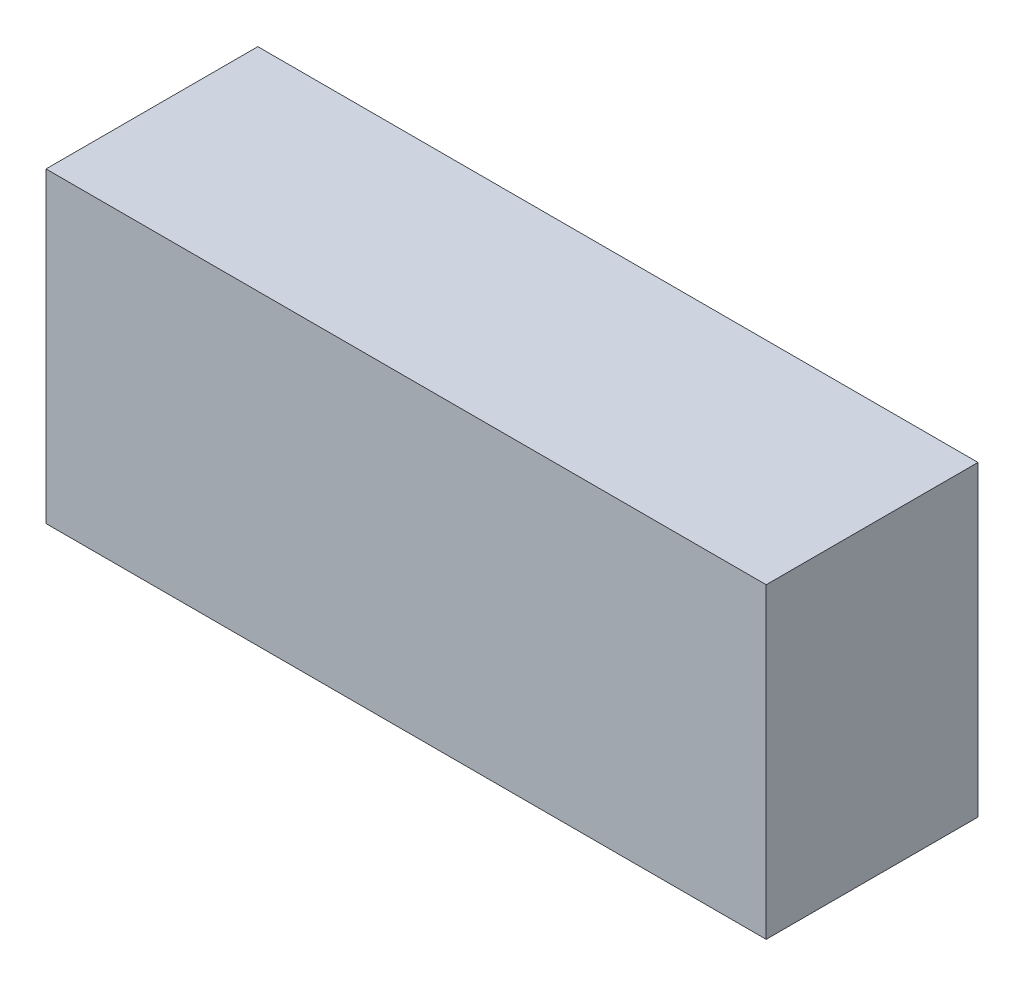
ISO-10303-21;
HEADER;
FILE_DESCRIPTION(('STEP AP214'),'2;1');
FILE_NAME('part.step','',(''),(''),'','','');
FILE_SCHEMA(('AUTOMOTIVE_DESIGN { 1 0 10303 214 1 1 1 1 }'));
ENDSEC;
DATA;
#1=APPLICATION_CONTEXT('core data for automotive mechanical design processes');
#2=APPLICATION_PROTOCOL_DEFINITION('international standard','automotive_design',2000,#1);
#3=PRODUCT_CONTEXT('',#1,'mechanical');
#4=PRODUCT('Part','Part','',(#3));
#5=PRODUCT_RELATED_PRODUCT_CATEGORY('part','',(#4));
#6=PRODUCT_DEFINITION_FORMATION('','',#4);
#7=PRODUCT_DEFINITION_CONTEXT('part definition',#1,'design');
#8=PRODUCT_DEFINITION('design','',#6,#7);
#9=PRODUCT_DEFINITION_SHAPE('','',#8);
#10=(LENGTH_UNIT() NAMED_UNIT(*) SI_UNIT(.MILLI.,.METRE.));
#11=(NAMED_UNIT(*) PLANE_ANGLE_UNIT() SI_UNIT($,.RADIAN.));
#12=(NAMED_UNIT(*) SI_UNIT($,.STERADIAN.) SOLID_ANGLE_UNIT());
#13=UNCERTAINTY_MEASURE_WITH_UNIT(LENGTH_MEASURE(1.E-05),#10,'distance_accuracy_value','');
#14=(GEOMETRIC_REPRESENTATION_CONTEXT(3) GLOBAL_UNCERTAINTY_ASSIGNED_CONTEXT((#13)) GLOBAL_UNIT_ASSIGNED_CONTEXT((#10,
#11,#12)) REPRESENTATION_CONTEXT('',''));
#15=CARTESIAN_POINT('',(0.,0.,0.));
#16=DIRECTION('',(0.,0.,1.));
#17=DIRECTION('',(1.,0.,0.));
#18=AXIS2_PLACEMENT_3D('',#15,#16,#17);
#19=CARTESIAN_POINT('',(-38.3501335211433,29.9527027027027,20.));
#20=DIRECTION('',(1.,0.,0.));
#21=DIRECTION('',(0.,0.,-1.));
#22=AXIS2_PLACEMENT_3D('',#19,#20,#21);
#23=PLANE('',#22);
#24=DIRECTION('',(0.,-1.,0.));
#25=VECTOR('',#24,1.);
#26=CARTESIAN_POINT('',(-38.3501335211433,29.9527027027027,0.));
#27=LINE('',#26,#25);
#28=CARTESIAN_POINT('',(-38.3501335211433,29.9527027027027,0.));
#29=VERTEX_POINT('',#28);
#30=CARTESIAN_POINT('',(-38.3501335211433,0.952702702702701,0.));
#31=VERTEX_POINT('',#30);
#32=EDGE_CURVE('E107',#29,#31,#27,.T.);
#33=ORIENTED_EDGE('',*,*,#32,.T.);
#34=DIRECTION('',(0.,0.,-1.));
#35=VECTOR('',#34,1.);
#36=CARTESIAN_POINT('',(-38.3501335211433,0.952702702702701,20.));
#37=LINE('',#36,#35);
#38=CARTESIAN_POINT('',(-38.3501335211433,0.952702702702701,20.));
#39=VERTEX_POINT('',#38);
#40=EDGE_CURVE('E11',#39,#31,#37,.T.);
#41=ORIENTED_EDGE('',*,*,#40,.F.);
#42=DIRECTION('',(0.,-1.,0.));
#43=VECTOR('',#42,1.);
#44=CARTESIAN_POINT('',(-38.3501335211433,29.9527027027027,20.));
#45=LINE('',#44,#43);
#46=CARTESIAN_POINT('',(-38.3501335211433,29.9527027027027,20.));
#47=VERTEX_POINT('',#46);
#48=EDGE_CURVE('E91',#47,#39,#45,.T.);
#49=ORIENTED_EDGE('',*,*,#48,.F.);
#50=DIRECTION('',(0.,0.,-1.));
#51=VECTOR('',#50,1.);
#52=CARTESIAN_POINT('',(-38.3501335211433,29.9527027027027,20.));
#53=LINE('',#52,#51);
#54=EDGE_CURVE('E103',#47,#29,#53,.T.);
#55=ORIENTED_EDGE('',*,*,#54,.T.);
#56=EDGE_LOOP('',(#33,#41,#49,#55));
#57=FACE_BOUND('',#56,.T.);
#58=ADVANCED_FACE('F39',(#57),#23,.F.);
#59=CARTESIAN_POINT('',(-38.3501335211433,0.952702702702701,20.));
#60=DIRECTION('',(0.,1.,0.));
#61=DIRECTION('',(0.,0.,1.));
#62=AXIS2_PLACEMENT_3D('',#59,#60,#61);
#63=PLANE('',#62);
#64=DIRECTION('',(1.,0.,0.));
#65=VECTOR('',#64,1.);
#66=CARTESIAN_POINT('',(-38.3501335211433,0.952702702702701,0.));
#67=LINE('',#66,#65);
#68=CARTESIAN_POINT('',(29.6498664788567,0.952702702702701,0.));
#69=VERTEX_POINT('',#68);
#70=EDGE_CURVE('E96',#31,#69,#67,.T.);
#71=ORIENTED_EDGE('',*,*,#70,.T.);
#72=DIRECTION('',(0.,0.,-1.));
#73=VECTOR('',#72,1.);
#74=CARTESIAN_POINT('',(29.6498664788567,0.952702702702701,20.));
#75=LINE('',#74,#73);
#76=CARTESIAN_POINT('',(29.6498664788567,0.952702702702701,20.));
#77=VERTEX_POINT('',#76);
#78=EDGE_CURVE('E48',#77,#69,#75,.T.);
#79=ORIENTED_EDGE('',*,*,#78,.F.);
#80=DIRECTION('',(1.,0.,0.));
#81=VECTOR('',#80,1.);
#82=CARTESIAN_POINT('',(-38.3501335211433,0.952702702702701,20.));
#83=LINE('',#82,#81);
#84=EDGE_CURVE('E86',#39,#77,#83,.T.);
#85=ORIENTED_EDGE('',*,*,#84,.F.);
#86=ORIENTED_EDGE('',*,*,#40,.T.);
#87=EDGE_LOOP('',(#71,#79,#85,#86));
#88=FACE_BOUND('',#87,.T.);
#89=ADVANCED_FACE('F95',(#88),#63,.F.);
#90=CARTESIAN_POINT('',(29.6498664788567,29.9527027027027,20.));
#91=DIRECTION('',(-1.,0.,0.));
#92=DIRECTION('',(0.,-1.,0.));
#93=AXIS2_PLACEMENT_3D('',#90,#91,#92);
#94=PLANE('',#93);
#95=DIRECTION('',(0.,1.,0.));
#96=VECTOR('',#95,1.);
#97=CARTESIAN_POINT('',(29.6498664788567,29.9527027027027,0.));
#98=LINE('',#97,#96);
#99=CARTESIAN_POINT('',(29.6498664788567,29.9527027027027,0.));
#100=VERTEX_POINT('',#99);
#101=EDGE_CURVE('E73',#69,#100,#98,.T.);
#102=ORIENTED_EDGE('',*,*,#101,.T.);
#103=DIRECTION('',(0.,0.,-1.));
#104=VECTOR('',#103,1.);
#105=CARTESIAN_POINT('',(29.6498664788567,29.9527027027027,20.));
#106=LINE('',#105,#104);
#107=CARTESIAN_POINT('',(29.6498664788567,29.9527027027027,20.));
#108=VERTEX_POINT('',#107);
#109=EDGE_CURVE('E98',#108,#100,#106,.T.);
#110=ORIENTED_EDGE('',*,*,#109,.F.);
#111=DIRECTION('',(0.,1.,0.));
#112=VECTOR('',#111,1.);
#113=CARTESIAN_POINT('',(29.6498664788567,29.9527027027027,20.));
#114=LINE('',#113,#112);
#115=EDGE_CURVE('E89',#77,#108,#114,.T.);
#116=ORIENTED_EDGE('',*,*,#115,.F.);
#117=ORIENTED_EDGE('',*,*,#78,.T.);
#118=EDGE_LOOP('',(#102,#110,#116,#117));
#119=FACE_BOUND('',#118,.T.);
#120=ADVANCED_FACE('F99',(#119),#94,.F.);
#121=CARTESIAN_POINT('',(-38.3501335211433,29.9527027027027,20.));
#122=DIRECTION('',(0.,-1.,0.));
#123=DIRECTION('',(0.,0.,-1.));
#124=AXIS2_PLACEMENT_3D('',#121,#122,#123);
#125=PLANE('',#124);
#126=DIRECTION('',(-1.,0.,0.));
#127=VECTOR('',#126,1.);
#128=CARTESIAN_POINT('',(-38.3501335211433,29.9527027027027,0.));
#129=LINE('',#128,#127);
#130=EDGE_CURVE('E79',#100,#29,#129,.T.);
#131=ORIENTED_EDGE('',*,*,#130,.T.);
#132=ORIENTED_EDGE('',*,*,#54,.F.);
#133=DIRECTION('',(-1.,0.,0.));
#134=VECTOR('',#133,1.);
#135=CARTESIAN_POINT('',(-38.3501335211433,29.9527027027027,20.));
#136=LINE('',#135,#134);
#137=EDGE_CURVE('E56',#108,#47,#136,.T.);
#138=ORIENTED_EDGE('',*,*,#137,.F.);
#139=ORIENTED_EDGE('',*,*,#109,.T.);
#140=EDGE_LOOP('',(#131,#132,#138,#139));
#141=FACE_BOUND('',#140,.T.);
#142=ADVANCED_FACE('F120',(#141),#125,.F.);
#143=CARTESIAN_POINT('',(0.,0.,20.));
#144=DIRECTION('',(0.,0.,1.));
#145=DIRECTION('',(1.,0.,0.));
#146=AXIS2_PLACEMENT_3D('',#143,#144,#145);
#147=PLANE('',#146);
#148=ORIENTED_EDGE('',*,*,#48,.T.);
#149=ORIENTED_EDGE('',*,*,#84,.T.);
#150=ORIENTED_EDGE('',*,*,#115,.T.);
#151=ORIENTED_EDGE('',*,*,#137,.T.);
#152=EDGE_LOOP('',(#148,#149,#150,#151));
#153=FACE_BOUND('',#152,.T.);
#154=ADVANCED_FACE('F87',(#153),#147,.T.);
#155=CARTESIAN_POINT('',(0.,0.,0.));
#156=DIRECTION('',(0.,0.,1.));
#157=DIRECTION('',(1.,0.,0.));
#158=AXIS2_PLACEMENT_3D('',#155,#156,#157);
#159=PLANE('',#158);
#160=ORIENTED_EDGE('',*,*,#32,.F.);
#161=ORIENTED_EDGE('',*,*,#130,.F.);
#162=ORIENTED_EDGE('',*,*,#101,.F.);
#163=ORIENTED_EDGE('',*,*,#70,.F.);
#164=EDGE_LOOP('',(#160,#161,#162,#163));
#165=FACE_BOUND('',#164,.T.);
#166=ADVANCED_FACE('F123',(#165),#159,.F.);
#167=CLOSED_SHELL('',(#58,#89,#120,#142,#154,#166));
#168=MANIFOLD_SOLID_BREP('B2',#167);
#169=ADVANCED_BREP_SHAPE_REPRESENTATION('',(#18,#168),#14);
#170=SHAPE_DEFINITION_REPRESENTATION(#9,#169);
ENDSEC;
END-ISO-10303-21;
